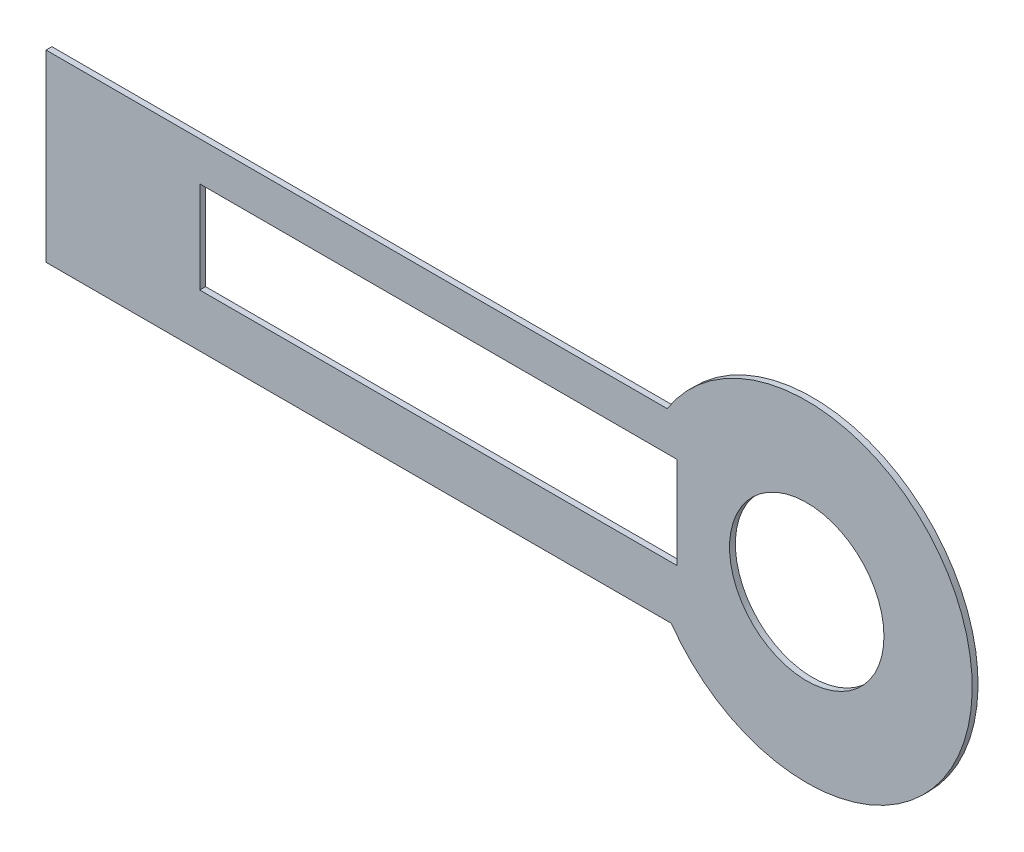
ISO-10303-21;
HEADER;
FILE_DESCRIPTION(('STEP AP214'),'2;1');
FILE_NAME('part.step','',(''),(''),'','','');
FILE_SCHEMA(('AUTOMOTIVE_DESIGN { 1 0 10303 214 1 1 1 1 }'));
ENDSEC;
DATA;
#1=APPLICATION_CONTEXT('core data for automotive mechanical design processes');
#2=APPLICATION_PROTOCOL_DEFINITION('international standard','automotive_design',2000,#1);
#3=PRODUCT_CONTEXT('',#1,'mechanical');
#4=PRODUCT('Part','Part','',(#3));
#5=PRODUCT_RELATED_PRODUCT_CATEGORY('part','',(#4));
#6=PRODUCT_DEFINITION_FORMATION('','',#4);
#7=PRODUCT_DEFINITION_CONTEXT('part definition',#1,'design');
#8=PRODUCT_DEFINITION('design','',#6,#7);
#9=PRODUCT_DEFINITION_SHAPE('','',#8);
#10=(LENGTH_UNIT() NAMED_UNIT(*) SI_UNIT(.MILLI.,.METRE.));
#11=(NAMED_UNIT(*) PLANE_ANGLE_UNIT() SI_UNIT($,.RADIAN.));
#12=(NAMED_UNIT(*) SI_UNIT($,.STERADIAN.) SOLID_ANGLE_UNIT());
#13=UNCERTAINTY_MEASURE_WITH_UNIT(LENGTH_MEASURE(1.E-05),#10,'distance_accuracy_value','');
#14=(GEOMETRIC_REPRESENTATION_CONTEXT(3) GLOBAL_UNCERTAINTY_ASSIGNED_CONTEXT((#13)) GLOBAL_UNIT_ASSIGNED_CONTEXT((#10,
#11,#12)) REPRESENTATION_CONTEXT('',''));
#15=CARTESIAN_POINT('',(0.,0.,0.));
#16=DIRECTION('',(0.,0.,1.));
#17=DIRECTION('',(1.,0.,0.));
#18=AXIS2_PLACEMENT_3D('',#15,#16,#17);
#19=CARTESIAN_POINT('',(0.,0.,0.3175));
#20=DIRECTION('',(0.,0.,-1.));
#21=DIRECTION('',(-1.,0.,0.));
#22=AXIS2_PLACEMENT_3D('',#19,#20,#21);
#23=CYLINDRICAL_SURFACE('',#22,9.);
#24=CARTESIAN_POINT('',(0.,0.,0.));
#25=DIRECTION('',(0.,0.,1.));
#26=DIRECTION('',(1.,0.,0.));
#27=AXIS2_PLACEMENT_3D('',#24,#25,#26);
#28=CIRCLE('',#27,9.);
#29=CARTESIAN_POINT('',(-7.36801911711828,-5.16839378238341,0.));
#30=VERTEX_POINT('',#29);
#31=CARTESIAN_POINT('',(-7.59312724494254,4.8316062176166,0.));
#32=VERTEX_POINT('',#31);
#33=EDGE_CURVE('E187',#30,#32,#28,.T.);
#34=ORIENTED_EDGE('',*,*,#33,.T.);
#35=DIRECTION('',(0.,0.,-1.));
#36=VECTOR('',#35,1.);
#37=CARTESIAN_POINT('',(-7.59312724494254,4.8316062176166,0.3175));
#38=LINE('',#37,#36);
#39=CARTESIAN_POINT('',(-7.59312724494254,4.8316062176166,0.3175));
#40=VERTEX_POINT('',#39);
#41=EDGE_CURVE('E12',#40,#32,#38,.T.);
#42=ORIENTED_EDGE('',*,*,#41,.F.);
#43=CARTESIAN_POINT('',(0.,0.,0.3175));
#44=DIRECTION('',(0.,0.,1.));
#45=DIRECTION('',(1.,0.,0.));
#46=AXIS2_PLACEMENT_3D('',#43,#44,#45);
#47=CIRCLE('',#46,9.);
#48=CARTESIAN_POINT('',(-7.36801911711828,-5.16839378238341,0.3175));
#49=VERTEX_POINT('',#48);
#50=EDGE_CURVE('E167',#49,#40,#47,.T.);
#51=ORIENTED_EDGE('',*,*,#50,.F.);
#52=DIRECTION('',(0.,0.,-1.));
#53=VECTOR('',#52,1.);
#54=CARTESIAN_POINT('',(-7.36801911711828,-5.16839378238341,0.3175));
#55=LINE('',#54,#53);
#56=EDGE_CURVE('E186',#49,#30,#55,.T.);
#57=ORIENTED_EDGE('',*,*,#56,.T.);
#58=EDGE_LOOP('',(#34,#42,#51,#57));
#59=FACE_BOUND('',#58,.T.);
#60=ADVANCED_FACE('F44',(#59),#23,.T.);
#61=CARTESIAN_POINT('',(0.,4.8316062176166,0.3175));
#62=DIRECTION('',(0.,-1.,0.));
#63=DIRECTION('',(1.,0.,0.));
#64=AXIS2_PLACEMENT_3D('',#61,#62,#63);
#65=PLANE('',#64);
#66=DIRECTION('',(-1.,0.,0.));
#67=VECTOR('',#66,1.);
#68=CARTESIAN_POINT('',(0.,4.8316062176166,0.));
#69=LINE('',#68,#67);
#70=CARTESIAN_POINT('',(-41.3757155311224,4.83160621761659,0.));
#71=VERTEX_POINT('',#70);
#72=EDGE_CURVE('E191',#32,#71,#69,.T.);
#73=ORIENTED_EDGE('',*,*,#72,.T.);
#74=DIRECTION('',(0.,0.,-1.));
#75=VECTOR('',#74,1.);
#76=CARTESIAN_POINT('',(-41.3757155311224,4.83160621761659,0.3175));
#77=LINE('',#76,#75);
#78=CARTESIAN_POINT('',(-41.3757155311224,4.83160621761659,0.3175));
#79=VERTEX_POINT('',#78);
#80=EDGE_CURVE('E52',#79,#71,#77,.T.);
#81=ORIENTED_EDGE('',*,*,#80,.F.);
#82=DIRECTION('',(-1.,0.,0.));
#83=VECTOR('',#82,1.);
#84=CARTESIAN_POINT('',(0.,4.8316062176166,0.3175));
#85=LINE('',#84,#83);
#86=EDGE_CURVE('E172',#40,#79,#85,.T.);
#87=ORIENTED_EDGE('',*,*,#86,.F.);
#88=ORIENTED_EDGE('',*,*,#41,.T.);
#89=EDGE_LOOP('',(#73,#81,#87,#88));
#90=FACE_BOUND('',#89,.T.);
#91=ADVANCED_FACE('F254',(#90),#65,.F.);
#92=CARTESIAN_POINT('',(-41.3757155311224,0.,0.3175));
#93=DIRECTION('',(1.,0.,0.));
#94=DIRECTION('',(0.,0.,-1.));
#95=AXIS2_PLACEMENT_3D('',#92,#93,#94);
#96=PLANE('',#95);
#97=DIRECTION('',(0.,-1.,0.));
#98=VECTOR('',#97,1.);
#99=CARTESIAN_POINT('',(-41.3757155311224,0.,0.));
#100=LINE('',#99,#98);
#101=CARTESIAN_POINT('',(-41.3757155311224,-5.16839378238341,0.));
#102=VERTEX_POINT('',#101);
#103=EDGE_CURVE('E195',#71,#102,#100,.T.);
#104=ORIENTED_EDGE('',*,*,#103,.T.);
#105=DIRECTION('',(0.,0.,-1.));
#106=VECTOR('',#105,1.);
#107=CARTESIAN_POINT('',(-41.3757155311224,-5.16839378238341,0.3175));
#108=LINE('',#107,#106);
#109=CARTESIAN_POINT('',(-41.3757155311224,-5.16839378238341,0.3175));
#110=VERTEX_POINT('',#109);
#111=EDGE_CURVE('E204',#110,#102,#108,.T.);
#112=ORIENTED_EDGE('',*,*,#111,.F.);
#113=DIRECTION('',(0.,-1.,0.));
#114=VECTOR('',#113,1.);
#115=CARTESIAN_POINT('',(-41.3757155311224,0.,0.3175));
#116=LINE('',#115,#114);
#117=EDGE_CURVE('E178',#79,#110,#116,.T.);
#118=ORIENTED_EDGE('',*,*,#117,.F.);
#119=ORIENTED_EDGE('',*,*,#80,.T.);
#120=EDGE_LOOP('',(#104,#112,#118,#119));
#121=FACE_BOUND('',#120,.T.);
#122=ADVANCED_FACE('F212',(#121),#96,.F.);
#123=CARTESIAN_POINT('',(0.,-5.16839378238341,0.3175));
#124=DIRECTION('',(0.,-1.,0.));
#125=DIRECTION('',(0.,0.,-1.));
#126=AXIS2_PLACEMENT_3D('',#123,#124,#125);
#127=PLANE('',#126);
#128=DIRECTION('',(-1.,0.,0.));
#129=VECTOR('',#128,1.);
#130=CARTESIAN_POINT('',(0.,-5.16839378238341,0.));
#131=LINE('',#130,#129);
#132=EDGE_CURVE('E173',#30,#102,#131,.T.);
#133=ORIENTED_EDGE('',*,*,#132,.F.);
#134=ORIENTED_EDGE('',*,*,#56,.F.);
#135=DIRECTION('',(-1.,0.,0.));
#136=VECTOR('',#135,1.);
#137=CARTESIAN_POINT('',(0.,-5.16839378238341,0.3175));
#138=LINE('',#137,#136);
#139=EDGE_CURVE('E181',#49,#110,#138,.T.);
#140=ORIENTED_EDGE('',*,*,#139,.T.);
#141=ORIENTED_EDGE('',*,*,#111,.T.);
#142=EDGE_LOOP('',(#133,#134,#140,#141));
#143=FACE_BOUND('',#142,.T.);
#144=ADVANCED_FACE('F218',(#143),#127,.T.);
#145=CARTESIAN_POINT('',(0.,0.,0.3175));
#146=DIRECTION('',(0.,0.,1.));
#147=DIRECTION('',(1.,0.,0.));
#148=AXIS2_PLACEMENT_3D('',#145,#146,#147);
#149=PLANE('',#148);
#150=CARTESIAN_POINT('',(0.,0.,0.3175));
#151=DIRECTION('',(0.,0.,1.));
#152=DIRECTION('',(1.,0.,0.));
#153=AXIS2_PLACEMENT_3D('',#150,#151,#152);
#154=CIRCLE('',#153,4.2);
#155=CARTESIAN_POINT('',(4.2,0.,0.3175));
#156=VERTEX_POINT('',#155);
#157=EDGE_CURVE('E137',#156,#156,#154,.T.);
#158=ORIENTED_EDGE('',*,*,#157,.F.);
#159=EDGE_LOOP('',(#158));
#160=FACE_BOUND('',#159,.T.);
#161=DIRECTION('',(0.,-1.,0.));
#162=VECTOR('',#161,1.);
#163=CARTESIAN_POINT('',(-33.0123226998637,2.70795865394024,0.3175));
#164=LINE('',#163,#162);
#165=CARTESIAN_POINT('',(-33.0123226998637,2.70795865394024,0.3175));
#166=VERTEX_POINT('',#165);
#167=CARTESIAN_POINT('',(-33.0123226998637,-2.29204134605976,0.3175));
#168=VERTEX_POINT('',#167);
#169=EDGE_CURVE('E59',#166,#168,#164,.T.);
#170=ORIENTED_EDGE('',*,*,#169,.F.);
#171=DIRECTION('',(-1.,0.,0.));
#172=VECTOR('',#171,1.);
#173=CARTESIAN_POINT('',(-33.0123226998637,2.70795865394024,0.3175));
#174=LINE('',#173,#172);
#175=CARTESIAN_POINT('',(-7.05569862500507,2.70795865394024,0.3175));
#176=VERTEX_POINT('',#175);
#177=EDGE_CURVE('E130',#176,#166,#174,.T.);
#178=ORIENTED_EDGE('',*,*,#177,.F.);
#179=DIRECTION('',(0.,1.,0.));
#180=VECTOR('',#179,1.);
#181=CARTESIAN_POINT('',(-7.05569862500507,2.70795865394024,0.3175));
#182=LINE('',#181,#180);
#183=CARTESIAN_POINT('',(-7.05569862500507,-2.29204134605976,0.3175));
#184=VERTEX_POINT('',#183);
#185=EDGE_CURVE('E134',#184,#176,#182,.T.);
#186=ORIENTED_EDGE('',*,*,#185,.F.);
#187=DIRECTION('',(1.,0.,0.));
#188=VECTOR('',#187,1.);
#189=CARTESIAN_POINT('',(-33.0123226998637,-2.29204134605976,0.3175));
#190=LINE('',#189,#188);
#191=EDGE_CURVE('E148',#168,#184,#190,.T.);
#192=ORIENTED_EDGE('',*,*,#191,.F.);
#193=EDGE_LOOP('',(#170,#178,#186,#192));
#194=FACE_BOUND('',#193,.T.);
#195=ORIENTED_EDGE('',*,*,#50,.T.);
#196=ORIENTED_EDGE('',*,*,#86,.T.);
#197=ORIENTED_EDGE('',*,*,#117,.T.);
#198=ORIENTED_EDGE('',*,*,#139,.F.);
#199=EDGE_LOOP('',(#195,#196,#197,#198));
#200=FACE_BOUND('',#199,.T.);
#201=ADVANCED_FACE('F222',(#160,#194,#200),#149,.T.);
#202=CARTESIAN_POINT('',(0.,0.,0.));
#203=DIRECTION('',(0.,0.,1.));
#204=DIRECTION('',(1.,0.,0.));
#205=AXIS2_PLACEMENT_3D('',#202,#203,#204);
#206=PLANE('',#205);
#207=CARTESIAN_POINT('',(0.,0.,0.));
#208=DIRECTION('',(0.,0.,1.));
#209=DIRECTION('',(1.,0.,0.));
#210=AXIS2_PLACEMENT_3D('',#207,#208,#209);
#211=CIRCLE('',#210,4.2);
#212=CARTESIAN_POINT('',(4.2,0.,0.));
#213=VERTEX_POINT('',#212);
#214=EDGE_CURVE('E192',#213,#213,#211,.T.);
#215=ORIENTED_EDGE('',*,*,#214,.T.);
#216=EDGE_LOOP('',(#215));
#217=FACE_BOUND('',#216,.T.);
#218=DIRECTION('',(-1.,0.,0.));
#219=VECTOR('',#218,1.);
#220=CARTESIAN_POINT('',(-33.0123226998637,2.70795865394024,0.));
#221=LINE('',#220,#219);
#222=CARTESIAN_POINT('',(-7.05569862500507,2.70795865394024,0.));
#223=VERTEX_POINT('',#222);
#224=CARTESIAN_POINT('',(-33.0123226998637,2.70795865394024,0.));
#225=VERTEX_POINT('',#224);
#226=EDGE_CURVE('E118',#223,#225,#221,.T.);
#227=ORIENTED_EDGE('',*,*,#226,.T.);
#228=DIRECTION('',(0.,-1.,0.));
#229=VECTOR('',#228,1.);
#230=CARTESIAN_POINT('',(-33.0123226998637,2.70795865394024,0.));
#231=LINE('',#230,#229);
#232=CARTESIAN_POINT('',(-33.0123226998637,-2.29204134605976,0.));
#233=VERTEX_POINT('',#232);
#234=EDGE_CURVE('E111',#225,#233,#231,.T.);
#235=ORIENTED_EDGE('',*,*,#234,.T.);
#236=DIRECTION('',(1.,0.,0.));
#237=VECTOR('',#236,1.);
#238=CARTESIAN_POINT('',(-33.0123226998637,-2.29204134605976,0.));
#239=LINE('',#238,#237);
#240=CARTESIAN_POINT('',(-7.05569862500507,-2.29204134605976,0.));
#241=VERTEX_POINT('',#240);
#242=EDGE_CURVE('E121',#233,#241,#239,.T.);
#243=ORIENTED_EDGE('',*,*,#242,.T.);
#244=DIRECTION('',(0.,1.,0.));
#245=VECTOR('',#244,1.);
#246=CARTESIAN_POINT('',(-7.05569862500507,2.70795865394024,0.));
#247=LINE('',#246,#245);
#248=EDGE_CURVE('E67',#241,#223,#247,.T.);
#249=ORIENTED_EDGE('',*,*,#248,.T.);
#250=EDGE_LOOP('',(#227,#235,#243,#249));
#251=FACE_BOUND('',#250,.T.);
#252=ORIENTED_EDGE('',*,*,#33,.F.);
#253=ORIENTED_EDGE('',*,*,#132,.T.);
#254=ORIENTED_EDGE('',*,*,#103,.F.);
#255=ORIENTED_EDGE('',*,*,#72,.F.);
#256=EDGE_LOOP('',(#252,#253,#254,#255));
#257=FACE_BOUND('',#256,.T.);
#258=ADVANCED_FACE('F126',(#217,#251,#257),#206,.F.);
#259=CARTESIAN_POINT('',(-33.0123226998637,2.70795865394024,0.));
#260=DIRECTION('',(-1.,0.,0.));
#261=DIRECTION('',(0.,0.,1.));
#262=AXIS2_PLACEMENT_3D('',#259,#260,#261);
#263=PLANE('',#262);
#264=ORIENTED_EDGE('',*,*,#169,.T.);
#265=DIRECTION('',(0.,0.,1.));
#266=VECTOR('',#265,1.);
#267=CARTESIAN_POINT('',(-33.0123226998637,-2.29204134605976,0.));
#268=LINE('',#267,#266);
#269=EDGE_CURVE('E107',#233,#168,#268,.T.);
#270=ORIENTED_EDGE('',*,*,#269,.F.);
#271=ORIENTED_EDGE('',*,*,#234,.F.);
#272=DIRECTION('',(0.,0.,1.));
#273=VECTOR('',#272,1.);
#274=CARTESIAN_POINT('',(-33.0123226998637,2.70795865394024,0.));
#275=LINE('',#274,#273);
#276=EDGE_CURVE('E159',#225,#166,#275,.T.);
#277=ORIENTED_EDGE('',*,*,#276,.T.);
#278=EDGE_LOOP('',(#264,#270,#271,#277));
#279=FACE_BOUND('',#278,.T.);
#280=ADVANCED_FACE('F109',(#279),#263,.F.);
#281=CARTESIAN_POINT('',(-33.0123226998637,2.70795865394024,0.));
#282=DIRECTION('',(0.,1.,0.));
#283=DIRECTION('',(0.,0.,1.));
#284=AXIS2_PLACEMENT_3D('',#281,#282,#283);
#285=PLANE('',#284);
#286=ORIENTED_EDGE('',*,*,#177,.T.);
#287=ORIENTED_EDGE('',*,*,#276,.F.);
#288=ORIENTED_EDGE('',*,*,#226,.F.);
#289=DIRECTION('',(0.,0.,1.));
#290=VECTOR('',#289,1.);
#291=CARTESIAN_POINT('',(-7.05569862500507,2.70795865394024,0.));
#292=LINE('',#291,#290);
#293=EDGE_CURVE('E162',#223,#176,#292,.T.);
#294=ORIENTED_EDGE('',*,*,#293,.T.);
#295=EDGE_LOOP('',(#286,#287,#288,#294));
#296=FACE_BOUND('',#295,.T.);
#297=ADVANCED_FACE('F243',(#296),#285,.F.);
#298=CARTESIAN_POINT('',(-7.05569862500507,2.70795865394024,0.));
#299=DIRECTION('',(1.,0.,0.));
#300=DIRECTION('',(0.,0.,-1.));
#301=AXIS2_PLACEMENT_3D('',#298,#299,#300);
#302=PLANE('',#301);
#303=ORIENTED_EDGE('',*,*,#185,.T.);
#304=ORIENTED_EDGE('',*,*,#293,.F.);
#305=ORIENTED_EDGE('',*,*,#248,.F.);
#306=DIRECTION('',(0.,0.,1.));
#307=VECTOR('',#306,1.);
#308=CARTESIAN_POINT('',(-7.05569862500507,-2.29204134605976,0.));
#309=LINE('',#308,#307);
#310=EDGE_CURVE('E117',#241,#184,#309,.T.);
#311=ORIENTED_EDGE('',*,*,#310,.T.);
#312=EDGE_LOOP('',(#303,#304,#305,#311));
#313=FACE_BOUND('',#312,.T.);
#314=ADVANCED_FACE('F241',(#313),#302,.F.);
#315=CARTESIAN_POINT('',(-33.0123226998637,-2.29204134605976,0.));
#316=DIRECTION('',(0.,-1.,0.));
#317=DIRECTION('',(0.,0.,-1.));
#318=AXIS2_PLACEMENT_3D('',#315,#316,#317);
#319=PLANE('',#318);
#320=ORIENTED_EDGE('',*,*,#191,.T.);
#321=ORIENTED_EDGE('',*,*,#310,.F.);
#322=ORIENTED_EDGE('',*,*,#242,.F.);
#323=ORIENTED_EDGE('',*,*,#269,.T.);
#324=EDGE_LOOP('',(#320,#321,#322,#323));
#325=FACE_BOUND('',#324,.T.);
#326=ADVANCED_FACE('F122',(#325),#319,.F.);
#327=CARTESIAN_POINT('',(0.,0.,0.));
#328=DIRECTION('',(0.,0.,1.));
#329=DIRECTION('',(1.,0.,0.));
#330=AXIS2_PLACEMENT_3D('',#327,#328,#329);
#331=CYLINDRICAL_SURFACE('',#330,4.2);
#332=ORIENTED_EDGE('',*,*,#214,.F.);
#333=EDGE_LOOP('',(#332));
#334=FACE_BOUND('',#333,.T.);
#335=ORIENTED_EDGE('',*,*,#157,.T.);
#336=EDGE_LOOP('',(#335));
#337=FACE_BOUND('',#336,.T.);
#338=ADVANCED_FACE('F231',(#334,#337),#331,.F.);
#339=CLOSED_SHELL('',(#60,#91,#122,#144,#201,#258,#280,#297,#314,#326,#338));
#340=MANIFOLD_SOLID_BREP('B2',#339);
#341=ADVANCED_BREP_SHAPE_REPRESENTATION('',(#18,#340),#14);
#342=SHAPE_DEFINITION_REPRESENTATION(#9,#341);
ENDSEC;
END-ISO-10303-21;
